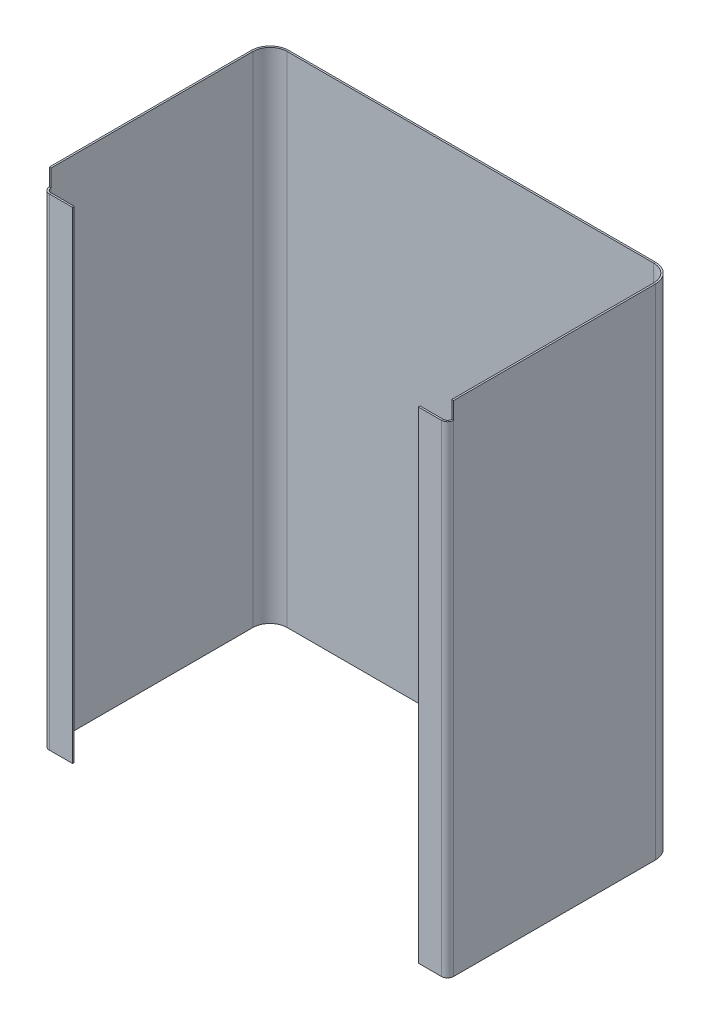
ISO-10303-21;
HEADER;
FILE_DESCRIPTION(('STEP AP214'),'2;1');
FILE_NAME('part.step','',(''),(''),'','','');
FILE_SCHEMA(('AUTOMOTIVE_DESIGN { 1 0 10303 214 1 1 1 1 }'));
ENDSEC;
DATA;
#1=APPLICATION_CONTEXT('core data for automotive mechanical design processes');
#2=APPLICATION_PROTOCOL_DEFINITION('international standard','automotive_design',2000,#1);
#3=PRODUCT_CONTEXT('',#1,'mechanical');
#4=PRODUCT('Part','Part','',(#3));
#5=PRODUCT_RELATED_PRODUCT_CATEGORY('part','',(#4));
#6=PRODUCT_DEFINITION_FORMATION('','',#4);
#7=PRODUCT_DEFINITION_CONTEXT('part definition',#1,'design');
#8=PRODUCT_DEFINITION('design','',#6,#7);
#9=PRODUCT_DEFINITION_SHAPE('','',#8);
#10=(LENGTH_UNIT() NAMED_UNIT(*) SI_UNIT(.MILLI.,.METRE.));
#11=(NAMED_UNIT(*) PLANE_ANGLE_UNIT() SI_UNIT($,.RADIAN.));
#12=(NAMED_UNIT(*) SI_UNIT($,.STERADIAN.) SOLID_ANGLE_UNIT());
#13=UNCERTAINTY_MEASURE_WITH_UNIT(LENGTH_MEASURE(1.E-05),#10,'distance_accuracy_value','');
#14=(GEOMETRIC_REPRESENTATION_CONTEXT(3) GLOBAL_UNCERTAINTY_ASSIGNED_CONTEXT((#13)) GLOBAL_UNIT_ASSIGNED_CONTEXT((#10,
#11,#12)) REPRESENTATION_CONTEXT('',''));
#15=CARTESIAN_POINT('',(0.,0.,0.));
#16=DIRECTION('',(0.,0.,1.));
#17=DIRECTION('',(1.,0.,0.));
#18=AXIS2_PLACEMENT_3D('',#15,#16,#17);
#19=CARTESIAN_POINT('',(-114.,-145.,128.326439119053));
#20=DIRECTION('',(0.,-1.,0.));
#21=DIRECTION('',(0.,0.,1.));
#22=AXIS2_PLACEMENT_3D('',#19,#20,#21);
#23=CYLINDRICAL_SURFACE('',#22,3.5);
#24=DIRECTION('',(0.,-1.,0.));
#25=VECTOR('',#24,1.);
#26=CARTESIAN_POINT('',(-114.,145.,131.826439119053));
#27=LINE('',#26,#25);
#28=CARTESIAN_POINT('',(-114.,-145.,131.826439119053));
#29=VERTEX_POINT('',#28);
#30=CARTESIAN_POINT('',(-114.,135.,131.826439119053));
#31=VERTEX_POINT('',#30);
#32=EDGE_CURVE('E290',#29,#31,#27,.F.);
#33=ORIENTED_EDGE('',*,*,#32,.T.);
#34=CARTESIAN_POINT('',(-114.,135.,128.326439119053));
#35=DIRECTION('',(0.,-1.,0.));
#36=DIRECTION('',(0.,0.,-1.));
#37=AXIS2_PLACEMENT_3D('',#34,#35,#36);
#38=CIRCLE('',#37,3.5);
#39=CARTESIAN_POINT('',(-117.5,135.,128.326439119053));
#40=VERTEX_POINT('',#39);
#41=EDGE_CURVE('E494',#31,#40,#38,.T.);
#42=ORIENTED_EDGE('',*,*,#41,.T.);
#43=DIRECTION('',(0.,-1.,0.));
#44=VECTOR('',#43,1.);
#45=CARTESIAN_POINT('',(-117.5,-145.,128.326439119053));
#46=LINE('',#45,#44);
#47=CARTESIAN_POINT('',(-117.5,-145.,128.326439119053));
#48=VERTEX_POINT('',#47);
#49=EDGE_CURVE('E301',#48,#40,#46,.F.);
#50=ORIENTED_EDGE('',*,*,#49,.F.);
#51=CARTESIAN_POINT('',(-114.,-145.,128.326439119053));
#52=DIRECTION('',(0.,-1.,0.));
#53=DIRECTION('',(0.,0.,-1.));
#54=AXIS2_PLACEMENT_3D('',#51,#52,#53);
#55=CIRCLE('',#54,3.5);
#56=EDGE_CURVE('E305',#29,#48,#55,.T.);
#57=ORIENTED_EDGE('',*,*,#56,.F.);
#58=EDGE_LOOP('',(#33,#42,#50,#57));
#59=FACE_BOUND('',#58,.T.);
#60=ADVANCED_FACE('F114',(#59),#23,.T.);
#61=CARTESIAN_POINT('',(-114.,-145.,128.326439119053));
#62=DIRECTION('',(0.,-1.,0.));
#63=DIRECTION('',(0.,0.,1.));
#64=AXIS2_PLACEMENT_3D('',#61,#62,#63);
#65=CYLINDRICAL_SURFACE('',#64,2.5);
#66=CARTESIAN_POINT('',(-114.,135.,128.326439119053));
#67=DIRECTION('',(0.,1.,0.));
#68=DIRECTION('',(0.,0.,1.));
#69=AXIS2_PLACEMENT_3D('',#66,#67,#68);
#70=CIRCLE('',#69,2.5);
#71=CARTESIAN_POINT('',(-114.,135.,130.826439119053));
#72=VERTEX_POINT('',#71);
#73=CARTESIAN_POINT('',(-116.5,135.,128.326439119053));
#74=VERTEX_POINT('',#73);
#75=EDGE_CURVE('E491',#72,#74,#70,.F.);
#76=ORIENTED_EDGE('',*,*,#75,.F.);
#77=DIRECTION('',(0.,-1.,0.));
#78=VECTOR('',#77,1.);
#79=CARTESIAN_POINT('',(-114.,145.,130.826439119053));
#80=LINE('',#79,#78);
#81=CARTESIAN_POINT('',(-114.,-145.,130.826439119053));
#82=VERTEX_POINT('',#81);
#83=EDGE_CURVE('E279',#72,#82,#80,.T.);
#84=ORIENTED_EDGE('',*,*,#83,.T.);
#85=CARTESIAN_POINT('',(-114.,-145.,128.326439119053));
#86=DIRECTION('',(0.,-1.,0.));
#87=DIRECTION('',(0.,0.,-1.));
#88=AXIS2_PLACEMENT_3D('',#85,#86,#87);
#89=CIRCLE('',#88,2.5);
#90=CARTESIAN_POINT('',(-116.5,-145.,128.326439119053));
#91=VERTEX_POINT('',#90);
#92=EDGE_CURVE('E311',#82,#91,#89,.T.);
#93=ORIENTED_EDGE('',*,*,#92,.T.);
#94=DIRECTION('',(0.,-1.,0.));
#95=VECTOR('',#94,1.);
#96=CARTESIAN_POINT('',(-116.5,-145.,128.326439119053));
#97=LINE('',#96,#95);
#98=EDGE_CURVE('E308',#91,#74,#97,.F.);
#99=ORIENTED_EDGE('',*,*,#98,.T.);
#100=EDGE_LOOP('',(#76,#84,#93,#99));
#101=FACE_BOUND('',#100,.T.);
#102=ADVANCED_FACE('F489',(#101),#65,.F.);
#103=CARTESIAN_POINT('',(-9.18221156115843E-13,0.,131.826439119054));
#104=DIRECTION('',(0.,0.,-1.));
#105=DIRECTION('',(-1.,0.,0.));
#106=AXIS2_PLACEMENT_3D('',#103,#104,#105);
#107=PLANE('',#106);
#108=DIRECTION('',(1.,0.,0.));
#109=VECTOR('',#108,1.);
#110=CARTESIAN_POINT('',(-107.25,135.,131.826439119053));
#111=LINE('',#110,#109);
#112=CARTESIAN_POINT('',(-100.5,135.,131.826439119053));
#113=VERTEX_POINT('',#112);
#114=EDGE_CURVE('E131',#31,#113,#111,.T.);
#115=ORIENTED_EDGE('',*,*,#114,.F.);
#116=ORIENTED_EDGE('',*,*,#32,.F.);
#117=DIRECTION('',(1.,0.,0.));
#118=VECTOR('',#117,1.);
#119=CARTESIAN_POINT('',(-9.18221156115843E-13,-145.,131.826439119054));
#120=LINE('',#119,#118);
#121=CARTESIAN_POINT('',(-100.5,-145.,131.826439119053));
#122=VERTEX_POINT('',#121);
#123=EDGE_CURVE('E285',#29,#122,#120,.T.);
#124=ORIENTED_EDGE('',*,*,#123,.T.);
#125=DIRECTION('',(0.,1.,0.));
#126=VECTOR('',#125,1.);
#127=CARTESIAN_POINT('',(-100.5,0.,131.826439119053));
#128=LINE('',#127,#126);
#129=EDGE_CURVE('E288',#122,#113,#128,.T.);
#130=ORIENTED_EDGE('',*,*,#129,.T.);
#131=EDGE_LOOP('',(#115,#116,#124,#130));
#132=FACE_BOUND('',#131,.T.);
#133=ADVANCED_FACE('F477',(#132),#107,.F.);
#134=CARTESIAN_POINT('',(-9.11441261326789E-13,0.,130.826439119054));
#135=DIRECTION('',(0.,0.,-1.));
#136=DIRECTION('',(-1.,0.,0.));
#137=AXIS2_PLACEMENT_3D('',#134,#135,#136);
#138=PLANE('',#137);
#139=ORIENTED_EDGE('',*,*,#83,.F.);
#140=DIRECTION('',(1.,0.,0.));
#141=VECTOR('',#140,1.);
#142=CARTESIAN_POINT('',(-116.5,135.,130.826439119053));
#143=LINE('',#142,#141);
#144=CARTESIAN_POINT('',(-100.5,135.,130.826439119053));
#145=VERTEX_POINT('',#144);
#146=EDGE_CURVE('E265',#72,#145,#143,.T.);
#147=ORIENTED_EDGE('',*,*,#146,.T.);
#148=DIRECTION('',(0.,-1.,0.));
#149=VECTOR('',#148,1.);
#150=CARTESIAN_POINT('',(-100.5,145.,130.826439119053));
#151=LINE('',#150,#149);
#152=CARTESIAN_POINT('',(-100.5,-145.,130.826439119053));
#153=VERTEX_POINT('',#152);
#154=EDGE_CURVE('E278',#153,#145,#151,.F.);
#155=ORIENTED_EDGE('',*,*,#154,.F.);
#156=DIRECTION('',(-1.,0.,0.));
#157=VECTOR('',#156,1.);
#158=CARTESIAN_POINT('',(-100.5,-145.,130.826439119053));
#159=LINE('',#158,#157);
#160=EDGE_CURVE('E286',#82,#153,#159,.F.);
#161=ORIENTED_EDGE('',*,*,#160,.F.);
#162=EDGE_LOOP('',(#139,#147,#155,#161));
#163=FACE_BOUND('',#162,.T.);
#164=ADVANCED_FACE('F276',(#163),#138,.T.);
#165=CARTESIAN_POINT('',(-100.5,145.,131.826439119053));
#166=DIRECTION('',(-1.,0.,0.));
#167=DIRECTION('',(0.,0.,1.));
#168=AXIS2_PLACEMENT_3D('',#165,#166,#167);
#169=PLANE('',#168);
#170=DIRECTION('',(0.,0.,1.));
#171=VECTOR('',#170,1.);
#172=CARTESIAN_POINT('',(-100.5,135.,130.826439119053));
#173=LINE('',#172,#171);
#174=EDGE_CURVE('E262',#113,#145,#173,.F.);
#175=ORIENTED_EDGE('',*,*,#174,.F.);
#176=ORIENTED_EDGE('',*,*,#129,.F.);
#177=DIRECTION('',(0.,0.,-1.));
#178=VECTOR('',#177,1.);
#179=CARTESIAN_POINT('',(-100.5,-145.,131.826439119053));
#180=LINE('',#179,#178);
#181=EDGE_CURVE('E284',#122,#153,#180,.T.);
#182=ORIENTED_EDGE('',*,*,#181,.T.);
#183=ORIENTED_EDGE('',*,*,#154,.T.);
#184=EDGE_LOOP('',(#175,#176,#182,#183));
#185=FACE_BOUND('',#184,.T.);
#186=ADVANCED_FACE('F282',(#185),#169,.F.);
#187=CARTESIAN_POINT('',(114.,145.,128.326439119053));
#188=DIRECTION('',(0.,1.,0.));
#189=DIRECTION('',(0.,0.,1.));
#190=AXIS2_PLACEMENT_3D('',#187,#188,#189);
#191=CYLINDRICAL_SURFACE('',#190,3.5);
#192=DIRECTION('',(0.,1.,0.));
#193=VECTOR('',#192,1.);
#194=CARTESIAN_POINT('',(117.5,145.,128.326439119053));
#195=LINE('',#194,#193);
#196=CARTESIAN_POINT('',(117.5,135.,128.326439119053));
#197=VERTEX_POINT('',#196);
#198=CARTESIAN_POINT('',(117.5,-145.,128.326439119053));
#199=VERTEX_POINT('',#198);
#200=EDGE_CURVE('E462',#197,#199,#195,.F.);
#201=ORIENTED_EDGE('',*,*,#200,.F.);
#202=CARTESIAN_POINT('',(114.,135.,128.326439119053));
#203=DIRECTION('',(0.,-1.,0.));
#204=DIRECTION('',(0.,0.,-1.));
#205=AXIS2_PLACEMENT_3D('',#202,#203,#204);
#206=CIRCLE('',#205,3.5);
#207=CARTESIAN_POINT('',(114.,135.,131.826439119053));
#208=VERTEX_POINT('',#207);
#209=EDGE_CURVE('E512',#197,#208,#206,.T.);
#210=ORIENTED_EDGE('',*,*,#209,.T.);
#211=DIRECTION('',(0.,1.,0.));
#212=VECTOR('',#211,1.);
#213=CARTESIAN_POINT('',(114.,-145.,131.826439119053));
#214=LINE('',#213,#212);
#215=CARTESIAN_POINT('',(114.,-145.,131.826439119053));
#216=VERTEX_POINT('',#215);
#217=EDGE_CURVE('E528',#208,#216,#214,.F.);
#218=ORIENTED_EDGE('',*,*,#217,.T.);
#219=CARTESIAN_POINT('',(114.,-145.,128.326439119053));
#220=DIRECTION('',(0.,1.,0.));
#221=DIRECTION('',(0.,0.,1.));
#222=AXIS2_PLACEMENT_3D('',#219,#220,#221);
#223=CIRCLE('',#222,3.5);
#224=EDGE_CURVE('E470',#199,#216,#223,.F.);
#225=ORIENTED_EDGE('',*,*,#224,.F.);
#226=EDGE_LOOP('',(#201,#210,#218,#225));
#227=FACE_BOUND('',#226,.T.);
#228=ADVANCED_FACE('F563',(#227),#191,.T.);
#229=CARTESIAN_POINT('',(114.,145.,128.326439119053));
#230=DIRECTION('',(0.,1.,0.));
#231=DIRECTION('',(0.,0.,1.));
#232=AXIS2_PLACEMENT_3D('',#229,#230,#231);
#233=CYLINDRICAL_SURFACE('',#232,2.5);
#234=CARTESIAN_POINT('',(114.,135.,128.326439119053));
#235=DIRECTION('',(0.,-1.,0.));
#236=DIRECTION('',(0.,0.,-1.));
#237=AXIS2_PLACEMENT_3D('',#234,#235,#236);
#238=CIRCLE('',#237,2.5);
#239=CARTESIAN_POINT('',(116.5,135.,128.326439119053));
#240=VERTEX_POINT('',#239);
#241=CARTESIAN_POINT('',(114.,135.,130.826439119053));
#242=VERTEX_POINT('',#241);
#243=EDGE_CURVE('E506',#240,#242,#238,.T.);
#244=ORIENTED_EDGE('',*,*,#243,.F.);
#245=DIRECTION('',(0.,1.,0.));
#246=VECTOR('',#245,1.);
#247=CARTESIAN_POINT('',(116.5,145.,128.326439119053));
#248=LINE('',#247,#246);
#249=CARTESIAN_POINT('',(116.5,-145.,128.326439119053));
#250=VERTEX_POINT('',#249);
#251=EDGE_CURVE('E449',#240,#250,#248,.F.);
#252=ORIENTED_EDGE('',*,*,#251,.T.);
#253=CARTESIAN_POINT('',(114.,-145.,128.326439119053));
#254=DIRECTION('',(0.,1.,0.));
#255=DIRECTION('',(0.,0.,1.));
#256=AXIS2_PLACEMENT_3D('',#253,#254,#255);
#257=CIRCLE('',#256,2.5);
#258=CARTESIAN_POINT('',(114.,-145.,130.826439119053));
#259=VERTEX_POINT('',#258);
#260=EDGE_CURVE('E453',#250,#259,#257,.F.);
#261=ORIENTED_EDGE('',*,*,#260,.T.);
#262=DIRECTION('',(0.,1.,0.));
#263=VECTOR('',#262,1.);
#264=CARTESIAN_POINT('',(114.,-145.,130.826439119053));
#265=LINE('',#264,#263);
#266=EDGE_CURVE('E530',#259,#242,#265,.T.);
#267=ORIENTED_EDGE('',*,*,#266,.T.);
#268=EDGE_LOOP('',(#244,#252,#261,#267));
#269=FACE_BOUND('',#268,.T.);
#270=ADVANCED_FACE('F553',(#269),#233,.F.);
#271=CARTESIAN_POINT('',(9.18221156115842E-13,0.,131.826439119054));
#272=DIRECTION('',(0.,0.,-1.));
#273=DIRECTION('',(-1.,0.,0.));
#274=AXIS2_PLACEMENT_3D('',#271,#272,#273);
#275=PLANE('',#274);
#276=DIRECTION('',(1.,0.,0.));
#277=VECTOR('',#276,1.);
#278=CARTESIAN_POINT('',(107.25,135.,131.826439119053));
#279=LINE('',#278,#277);
#280=CARTESIAN_POINT('',(100.5,135.,131.826439119053));
#281=VERTEX_POINT('',#280);
#282=EDGE_CURVE('E498',#281,#208,#279,.T.);
#283=ORIENTED_EDGE('',*,*,#282,.F.);
#284=DIRECTION('',(0.,-1.,0.));
#285=VECTOR('',#284,1.);
#286=CARTESIAN_POINT('',(100.5,0.,131.826439119053));
#287=LINE('',#286,#285);
#288=CARTESIAN_POINT('',(100.5,-145.,131.826439119053));
#289=VERTEX_POINT('',#288);
#290=EDGE_CURVE('E521',#281,#289,#287,.T.);
#291=ORIENTED_EDGE('',*,*,#290,.T.);
#292=DIRECTION('',(1.,0.,0.));
#293=VECTOR('',#292,1.);
#294=CARTESIAN_POINT('',(9.18221156115842E-13,-145.,131.826439119054));
#295=LINE('',#294,#293);
#296=EDGE_CURVE('E518',#289,#216,#295,.T.);
#297=ORIENTED_EDGE('',*,*,#296,.T.);
#298=ORIENTED_EDGE('',*,*,#217,.F.);
#299=EDGE_LOOP('',(#283,#291,#297,#298));
#300=FACE_BOUND('',#299,.T.);
#301=ADVANCED_FACE('F543',(#300),#275,.F.);
#302=CARTESIAN_POINT('',(9.11016949913858E-13,0.,130.826439119054));
#303=DIRECTION('',(0.,0.,-1.));
#304=DIRECTION('',(-1.,0.,0.));
#305=AXIS2_PLACEMENT_3D('',#302,#303,#304);
#306=PLANE('',#305);
#307=DIRECTION('',(0.,1.,0.));
#308=VECTOR('',#307,1.);
#309=CARTESIAN_POINT('',(100.5,-145.,130.826439119053));
#310=LINE('',#309,#308);
#311=CARTESIAN_POINT('',(100.5,135.,130.826439119053));
#312=VERTEX_POINT('',#311);
#313=CARTESIAN_POINT('',(100.5,-145.,130.826439119053));
#314=VERTEX_POINT('',#313);
#315=EDGE_CURVE('E526',#312,#314,#310,.F.);
#316=ORIENTED_EDGE('',*,*,#315,.F.);
#317=DIRECTION('',(1.,0.,0.));
#318=VECTOR('',#317,1.);
#319=CARTESIAN_POINT('',(-116.5,135.,130.826439119055));
#320=LINE('',#319,#318);
#321=EDGE_CURVE('E139',#312,#242,#320,.T.);
#322=ORIENTED_EDGE('',*,*,#321,.T.);
#323=ORIENTED_EDGE('',*,*,#266,.F.);
#324=DIRECTION('',(-1.,0.,0.));
#325=VECTOR('',#324,1.);
#326=CARTESIAN_POINT('',(116.5,-145.,130.826439119053));
#327=LINE('',#326,#325);
#328=EDGE_CURVE('E523',#314,#259,#327,.F.);
#329=ORIENTED_EDGE('',*,*,#328,.F.);
#330=EDGE_LOOP('',(#316,#322,#323,#329));
#331=FACE_BOUND('',#330,.T.);
#332=ADVANCED_FACE('F551',(#331),#306,.T.);
#333=CARTESIAN_POINT('',(100.5,-145.,131.826439119053));
#334=DIRECTION('',(1.,0.,0.));
#335=DIRECTION('',(0.,0.,-1.));
#336=AXIS2_PLACEMENT_3D('',#333,#334,#335);
#337=PLANE('',#336);
#338=DIRECTION('',(0.,0.,1.));
#339=VECTOR('',#338,1.);
#340=CARTESIAN_POINT('',(100.5,135.,130.826439119053));
#341=LINE('',#340,#339);
#342=EDGE_CURVE('E507',#281,#312,#341,.F.);
#343=ORIENTED_EDGE('',*,*,#342,.T.);
#344=ORIENTED_EDGE('',*,*,#315,.T.);
#345=DIRECTION('',(0.,0.,-1.));
#346=VECTOR('',#345,1.);
#347=CARTESIAN_POINT('',(100.5,-145.,131.826439119053));
#348=LINE('',#347,#346);
#349=EDGE_CURVE('E515',#289,#314,#348,.T.);
#350=ORIENTED_EDGE('',*,*,#349,.F.);
#351=ORIENTED_EDGE('',*,*,#290,.F.);
#352=EDGE_LOOP('',(#343,#344,#350,#351));
#353=FACE_BOUND('',#352,.T.);
#354=ADVANCED_FACE('F548',(#353),#337,.F.);
#355=CARTESIAN_POINT('',(117.5,145.,131.826439119053));
#356=DIRECTION('',(0.,-1.,0.));
#357=DIRECTION('',(0.,0.,-1.));
#358=AXIS2_PLACEMENT_3D('',#355,#356,#357);
#359=PLANE('',#358);
#360=DIRECTION('',(1.,0.,0.));
#361=VECTOR('',#360,1.);
#362=CARTESIAN_POINT('',(116.5,145.,128.326439119053));
#363=LINE('',#362,#361);
#364=CARTESIAN_POINT('',(116.5,145.,128.326439119053));
#365=VERTEX_POINT('',#364);
#366=CARTESIAN_POINT('',(117.5,145.,128.326439119053));
#367=VERTEX_POINT('',#366);
#368=EDGE_CURVE('E473',#365,#367,#363,.T.);
#369=ORIENTED_EDGE('',*,*,#368,.T.);
#370=DIRECTION('',(0.,0.,1.));
#371=VECTOR('',#370,1.);
#372=CARTESIAN_POINT('',(117.5,145.,-4.39736652757907E-13));
#373=LINE('',#372,#371);
#374=CARTESIAN_POINT('',(117.5,145.,10.9999999999999));
#375=VERTEX_POINT('',#374);
#376=EDGE_CURVE('E322',#375,#367,#373,.T.);
#377=ORIENTED_EDGE('',*,*,#376,.F.);
#378=DIRECTION('',(-1.,0.,0.));
#379=VECTOR('',#378,1.);
#380=CARTESIAN_POINT('',(116.5,145.,10.9999999999999));
#381=LINE('',#380,#379);
#382=CARTESIAN_POINT('',(116.5,145.,10.9999999999999));
#383=VERTEX_POINT('',#382);
#384=EDGE_CURVE('E333',#383,#375,#381,.F.);
#385=ORIENTED_EDGE('',*,*,#384,.F.);
#386=DIRECTION('',(0.,0.,-1.));
#387=VECTOR('',#386,1.);
#388=CARTESIAN_POINT('',(116.5,145.,131.826439119053));
#389=LINE('',#388,#387);
#390=EDGE_CURVE('E327',#383,#365,#389,.F.);
#391=ORIENTED_EDGE('',*,*,#390,.T.);
#392=EDGE_LOOP('',(#369,#377,#385,#391));
#393=FACE_BOUND('',#392,.T.);
#394=ADVANCED_FACE('F560',(#393),#359,.F.);
#395=CARTESIAN_POINT('',(117.5,-145.,0.999999999999953));
#396=DIRECTION('',(0.,1.,0.));
#397=DIRECTION('',(0.,0.,1.));
#398=AXIS2_PLACEMENT_3D('',#395,#396,#397);
#399=PLANE('',#398);
#400=DIRECTION('',(1.,0.,0.));
#401=VECTOR('',#400,1.);
#402=CARTESIAN_POINT('',(116.5,-145.,128.326439119053));
#403=LINE('',#402,#401);
#404=EDGE_CURVE('E300',#250,#199,#403,.T.);
#405=ORIENTED_EDGE('',*,*,#404,.F.);
#406=DIRECTION('',(0.,0.,1.));
#407=VECTOR('',#406,1.);
#408=CARTESIAN_POINT('',(116.5,-145.,0.999999999999957));
#409=LINE('',#408,#407);
#410=CARTESIAN_POINT('',(116.5,-145.,10.9999999999999));
#411=VERTEX_POINT('',#410);
#412=EDGE_CURVE('E325',#250,#411,#409,.F.);
#413=ORIENTED_EDGE('',*,*,#412,.T.);
#414=DIRECTION('',(-1.,0.,0.));
#415=VECTOR('',#414,1.);
#416=CARTESIAN_POINT('',(117.5,-145.,10.9999999999999));
#417=LINE('',#416,#415);
#418=CARTESIAN_POINT('',(117.5,-145.,10.9999999999999));
#419=VERTEX_POINT('',#418);
#420=EDGE_CURVE('E316',#411,#419,#417,.F.);
#421=ORIENTED_EDGE('',*,*,#420,.T.);
#422=DIRECTION('',(0.,0.,-1.));
#423=VECTOR('',#422,1.);
#424=CARTESIAN_POINT('',(117.5,-145.,-4.39736652757907E-13));
#425=LINE('',#424,#423);
#426=EDGE_CURVE('E319',#199,#419,#425,.T.);
#427=ORIENTED_EDGE('',*,*,#426,.F.);
#428=EDGE_LOOP('',(#405,#413,#421,#427));
#429=FACE_BOUND('',#428,.T.);
#430=ADVANCED_FACE('F441',(#429),#399,.F.);
#431=CARTESIAN_POINT('',(117.5,0.,-4.39736652757907E-13));
#432=DIRECTION('',(-1.,0.,0.));
#433=DIRECTION('',(0.,0.,1.));
#434=AXIS2_PLACEMENT_3D('',#431,#432,#433);
#435=PLANE('',#434);
#436=EDGE_CURVE('E465',#367,#197,#195,.F.);
#437=ORIENTED_EDGE('',*,*,#436,.T.);
#438=ORIENTED_EDGE('',*,*,#200,.T.);
#439=ORIENTED_EDGE('',*,*,#426,.T.);
#440=DIRECTION('',(0.,1.,0.));
#441=VECTOR('',#440,1.);
#442=CARTESIAN_POINT('',(117.5,-145.,10.9999999999999));
#443=LINE('',#442,#441);
#444=EDGE_CURVE('E330',#375,#419,#443,.F.);
#445=ORIENTED_EDGE('',*,*,#444,.F.);
#446=ORIENTED_EDGE('',*,*,#376,.T.);
#447=EDGE_LOOP('',(#437,#438,#439,#445,#446));
#448=FACE_BOUND('',#447,.T.);
#449=ADVANCED_FACE('F562',(#448),#435,.F.);
#450=CARTESIAN_POINT('',(116.5,0.,-4.36061474399191E-13));
#451=DIRECTION('',(-1.,0.,0.));
#452=DIRECTION('',(0.,0.,1.));
#453=AXIS2_PLACEMENT_3D('',#450,#451,#452);
#454=PLANE('',#453);
#455=ORIENTED_EDGE('',*,*,#412,.F.);
#456=ORIENTED_EDGE('',*,*,#251,.F.);
#457=EDGE_CURVE('E463',#365,#240,#248,.F.);
#458=ORIENTED_EDGE('',*,*,#457,.F.);
#459=ORIENTED_EDGE('',*,*,#390,.F.);
#460=DIRECTION('',(0.,1.,0.));
#461=VECTOR('',#460,1.);
#462=CARTESIAN_POINT('',(116.5,-145.,10.9999999999999));
#463=LINE('',#462,#461);
#464=EDGE_CURVE('E336',#411,#383,#463,.T.);
#465=ORIENTED_EDGE('',*,*,#464,.F.);
#466=EDGE_LOOP('',(#455,#456,#458,#459,#465));
#467=FACE_BOUND('',#466,.T.);
#468=ADVANCED_FACE('F447',(#467),#454,.T.);
#469=CARTESIAN_POINT('',(-117.5,145.,0.999999999999997));
#470=DIRECTION('',(0.,-1.,0.));
#471=DIRECTION('',(0.,0.,-1.));
#472=AXIS2_PLACEMENT_3D('',#469,#470,#471);
#473=PLANE('',#472);
#474=DIRECTION('',(-1.,0.,0.));
#475=VECTOR('',#474,1.);
#476=CARTESIAN_POINT('',(-116.5,145.,128.326439119053));
#477=LINE('',#476,#475);
#478=CARTESIAN_POINT('',(-116.5,145.,128.326439119053));
#479=VERTEX_POINT('',#478);
#480=CARTESIAN_POINT('',(-117.5,145.,128.326439119053));
#481=VERTEX_POINT('',#480);
#482=EDGE_CURVE('E314',#479,#481,#477,.T.);
#483=ORIENTED_EDGE('',*,*,#482,.F.);
#484=DIRECTION('',(0.,0.,1.));
#485=VECTOR('',#484,1.);
#486=CARTESIAN_POINT('',(-116.5,145.,1.));
#487=LINE('',#486,#485);
#488=CARTESIAN_POINT('',(-116.5,145.,11.));
#489=VERTEX_POINT('',#488);
#490=EDGE_CURVE('E371',#479,#489,#487,.F.);
#491=ORIENTED_EDGE('',*,*,#490,.T.);
#492=DIRECTION('',(1.,0.,0.));
#493=VECTOR('',#492,1.);
#494=CARTESIAN_POINT('',(-117.5,145.,11.));
#495=LINE('',#494,#493);
#496=CARTESIAN_POINT('',(-117.5,145.,11.));
#497=VERTEX_POINT('',#496);
#498=EDGE_CURVE('E360',#489,#497,#495,.F.);
#499=ORIENTED_EDGE('',*,*,#498,.T.);
#500=DIRECTION('',(0.,0.,-1.));
#501=VECTOR('',#500,1.);
#502=CARTESIAN_POINT('',(-117.5,145.,-3.89880061738585E-13));
#503=LINE('',#502,#501);
#504=EDGE_CURVE('E366',#481,#497,#503,.T.);
#505=ORIENTED_EDGE('',*,*,#504,.F.);
#506=EDGE_LOOP('',(#483,#491,#499,#505));
#507=FACE_BOUND('',#506,.T.);
#508=ADVANCED_FACE('F588',(#507),#473,.F.);
#509=CARTESIAN_POINT('',(-117.5,-145.,131.826439119053));
#510=DIRECTION('',(0.,1.,0.));
#511=DIRECTION('',(0.,0.,1.));
#512=AXIS2_PLACEMENT_3D('',#509,#510,#511);
#513=PLANE('',#512);
#514=DIRECTION('',(-1.,0.,0.));
#515=VECTOR('',#514,1.);
#516=CARTESIAN_POINT('',(-116.5,-145.,128.326439119053));
#517=LINE('',#516,#515);
#518=EDGE_CURVE('E304',#91,#48,#517,.T.);
#519=ORIENTED_EDGE('',*,*,#518,.T.);
#520=DIRECTION('',(0.,0.,1.));
#521=VECTOR('',#520,1.);
#522=CARTESIAN_POINT('',(-117.5,-145.,-3.89880061738585E-13));
#523=LINE('',#522,#521);
#524=CARTESIAN_POINT('',(-117.5,-145.,11.));
#525=VERTEX_POINT('',#524);
#526=EDGE_CURVE('E363',#525,#48,#523,.T.);
#527=ORIENTED_EDGE('',*,*,#526,.F.);
#528=DIRECTION('',(1.,0.,0.));
#529=VECTOR('',#528,1.);
#530=CARTESIAN_POINT('',(-116.5,-145.,11.));
#531=LINE('',#530,#529);
#532=CARTESIAN_POINT('',(-116.5,-145.,11.));
#533=VERTEX_POINT('',#532);
#534=EDGE_CURVE('E376',#533,#525,#531,.F.);
#535=ORIENTED_EDGE('',*,*,#534,.F.);
#536=DIRECTION('',(0.,0.,-1.));
#537=VECTOR('',#536,1.);
#538=CARTESIAN_POINT('',(-116.5,-145.,131.826439119053));
#539=LINE('',#538,#537);
#540=EDGE_CURVE('E368',#533,#91,#539,.F.);
#541=ORIENTED_EDGE('',*,*,#540,.T.);
#542=EDGE_LOOP('',(#519,#527,#535,#541));
#543=FACE_BOUND('',#542,.T.);
#544=ADVANCED_FACE('F606',(#543),#513,.F.);
#545=CARTESIAN_POINT('',(-117.5,0.,-3.89880061738585E-13));
#546=DIRECTION('',(1.,0.,0.));
#547=DIRECTION('',(0.,0.,-1.));
#548=AXIS2_PLACEMENT_3D('',#545,#546,#547);
#549=PLANE('',#548);
#550=ORIENTED_EDGE('',*,*,#49,.T.);
#551=DIRECTION('',(0.,-1.,0.));
#552=VECTOR('',#551,1.);
#553=CARTESIAN_POINT('',(-117.5,-145.,128.326439119053));
#554=LINE('',#553,#552);
#555=EDGE_CURVE('E500',#40,#481,#554,.F.);
#556=ORIENTED_EDGE('',*,*,#555,.T.);
#557=ORIENTED_EDGE('',*,*,#504,.T.);
#558=DIRECTION('',(0.,-1.,0.));
#559=VECTOR('',#558,1.);
#560=CARTESIAN_POINT('',(-117.5,145.,11.));
#561=LINE('',#560,#559);
#562=EDGE_CURVE('E373',#525,#497,#561,.F.);
#563=ORIENTED_EDGE('',*,*,#562,.F.);
#564=ORIENTED_EDGE('',*,*,#526,.T.);
#565=EDGE_LOOP('',(#550,#556,#557,#563,#564));
#566=FACE_BOUND('',#565,.T.);
#567=ADVANCED_FACE('F602',(#566),#549,.F.);
#568=CARTESIAN_POINT('',(-116.5,0.,-3.86572277419614E-13));
#569=DIRECTION('',(1.,0.,0.));
#570=DIRECTION('',(0.,0.,-1.));
#571=AXIS2_PLACEMENT_3D('',#568,#569,#570);
#572=PLANE('',#571);
#573=ORIENTED_EDGE('',*,*,#490,.F.);
#574=DIRECTION('',(0.,-1.,0.));
#575=VECTOR('',#574,1.);
#576=CARTESIAN_POINT('',(-116.5,-145.,128.326439119053));
#577=LINE('',#576,#575);
#578=EDGE_CURVE('E980',#74,#479,#577,.F.);
#579=ORIENTED_EDGE('',*,*,#578,.F.);
#580=ORIENTED_EDGE('',*,*,#98,.F.);
#581=ORIENTED_EDGE('',*,*,#540,.F.);
#582=DIRECTION('',(0.,-1.,0.));
#583=VECTOR('',#582,1.);
#584=CARTESIAN_POINT('',(-116.5,145.,11.));
#585=LINE('',#584,#583);
#586=EDGE_CURVE('E379',#489,#533,#585,.T.);
#587=ORIENTED_EDGE('',*,*,#586,.F.);
#588=EDGE_LOOP('',(#573,#579,#580,#581,#587));
#589=FACE_BOUND('',#588,.T.);
#590=ADVANCED_FACE('F605',(#589),#572,.T.);
#591=CARTESIAN_POINT('',(-117.5,145.,1.));
#592=DIRECTION('',(0.,0.,-1.));
#593=DIRECTION('',(-1.,0.,0.));
#594=AXIS2_PLACEMENT_3D('',#591,#592,#593);
#595=PLANE('',#594);
#596=DIRECTION('',(0.,1.,0.));
#597=VECTOR('',#596,1.);
#598=CARTESIAN_POINT('',(106.5,145.,0.999999999999989));
#599=LINE('',#598,#597);
#600=CARTESIAN_POINT('',(106.5,145.,0.999999999999989));
#601=VERTEX_POINT('',#600);
#602=CARTESIAN_POINT('',(106.5,-145.,0.999999999999963));
#603=VERTEX_POINT('',#602);
#604=EDGE_CURVE('E353',#601,#603,#599,.F.);
#605=ORIENTED_EDGE('',*,*,#604,.F.);
#606=DIRECTION('',(1.,0.,0.));
#607=VECTOR('',#606,1.);
#608=CARTESIAN_POINT('',(-117.5,145.,1.));
#609=LINE('',#608,#607);
#610=CARTESIAN_POINT('',(-106.5,145.,0.999999999999999));
#611=VERTEX_POINT('',#610);
#612=EDGE_CURVE('E123',#611,#601,#609,.T.);
#613=ORIENTED_EDGE('',*,*,#612,.F.);
#614=DIRECTION('',(0.,-1.,0.));
#615=VECTOR('',#614,1.);
#616=CARTESIAN_POINT('',(-106.5,-145.,0.999999999999999));
#617=LINE('',#616,#615);
#618=CARTESIAN_POINT('',(-106.5,-145.,0.999999999999999));
#619=VERTEX_POINT('',#618);
#620=EDGE_CURVE('E396',#619,#611,#617,.F.);
#621=ORIENTED_EDGE('',*,*,#620,.F.);
#622=DIRECTION('',(1.,0.,0.));
#623=VECTOR('',#622,1.);
#624=CARTESIAN_POINT('',(-117.5,-145.,1.));
#625=LINE('',#624,#623);
#626=EDGE_CURVE('E403',#619,#603,#625,.T.);
#627=ORIENTED_EDGE('',*,*,#626,.T.);
#628=EDGE_LOOP('',(#605,#613,#621,#627));
#629=FACE_BOUND('',#628,.T.);
#630=ADVANCED_FACE('F116',(#629),#595,.F.);
#631=CARTESIAN_POINT('',(-117.5,145.,0.));
#632=DIRECTION('',(0.,0.,-1.));
#633=DIRECTION('',(-1.,0.,0.));
#634=AXIS2_PLACEMENT_3D('',#631,#632,#633);
#635=PLANE('',#634);
#636=DIRECTION('',(1.,0.,0.));
#637=VECTOR('',#636,1.);
#638=CARTESIAN_POINT('',(-117.5,145.,0.));
#639=LINE('',#638,#637);
#640=CARTESIAN_POINT('',(-106.5,145.,0.));
#641=VERTEX_POINT('',#640);
#642=CARTESIAN_POINT('',(106.5,145.,0.));
#643=VERTEX_POINT('',#642);
#644=EDGE_CURVE('E13',#641,#643,#639,.T.);
#645=ORIENTED_EDGE('',*,*,#644,.T.);
#646=DIRECTION('',(0.,1.,0.));
#647=VECTOR('',#646,1.);
#648=CARTESIAN_POINT('',(106.5,145.,0.));
#649=LINE('',#648,#647);
#650=CARTESIAN_POINT('',(106.5,-145.,0.));
#651=VERTEX_POINT('',#650);
#652=EDGE_CURVE('E340',#643,#651,#649,.F.);
#653=ORIENTED_EDGE('',*,*,#652,.T.);
#654=DIRECTION('',(1.,0.,0.));
#655=VECTOR('',#654,1.);
#656=CARTESIAN_POINT('',(-117.5,-145.,0.));
#657=LINE('',#656,#655);
#658=CARTESIAN_POINT('',(-106.5,-145.,0.));
#659=VERTEX_POINT('',#658);
#660=EDGE_CURVE('E118',#659,#651,#657,.T.);
#661=ORIENTED_EDGE('',*,*,#660,.F.);
#662=DIRECTION('',(0.,-1.,0.));
#663=VECTOR('',#662,1.);
#664=CARTESIAN_POINT('',(-106.5,-145.,0.));
#665=LINE('',#664,#663);
#666=EDGE_CURVE('E383',#659,#641,#665,.F.);
#667=ORIENTED_EDGE('',*,*,#666,.T.);
#668=EDGE_LOOP('',(#645,#653,#661,#667));
#669=FACE_BOUND('',#668,.T.);
#670=ADVANCED_FACE('F418',(#669),#635,.T.);
#671=CARTESIAN_POINT('',(0.,145.,0.));
#672=DIRECTION('',(0.,-1.,0.));
#673=DIRECTION('',(-1.,0.,0.));
#674=AXIS2_PLACEMENT_3D('',#671,#672,#673);
#675=PLANE('',#674);
#676=DIRECTION('',(0.,0.,-1.));
#677=VECTOR('',#676,1.);
#678=CARTESIAN_POINT('',(106.5,145.,0.999999999999989));
#679=LINE('',#678,#677);
#680=EDGE_CURVE('E347',#601,#643,#679,.T.);
#681=ORIENTED_EDGE('',*,*,#680,.T.);
#682=ORIENTED_EDGE('',*,*,#644,.F.);
#683=DIRECTION('',(0.,0.,-1.));
#684=VECTOR('',#683,1.);
#685=CARTESIAN_POINT('',(-106.5,145.,0.999999999999999));
#686=LINE('',#685,#684);
#687=EDGE_CURVE('E400',#611,#641,#686,.T.);
#688=ORIENTED_EDGE('',*,*,#687,.F.);
#689=ORIENTED_EDGE('',*,*,#612,.T.);
#690=EDGE_LOOP('',(#681,#682,#688,#689));
#691=FACE_BOUND('',#690,.T.);
#692=ADVANCED_FACE('F428',(#691),#675,.F.);
#693=CARTESIAN_POINT('',(0.,-145.,0.));
#694=DIRECTION('',(0.,-1.,0.));
#695=DIRECTION('',(-1.,0.,0.));
#696=AXIS2_PLACEMENT_3D('',#693,#694,#695);
#697=PLANE('',#696);
#698=DIRECTION('',(0.,0.,-1.));
#699=VECTOR('',#698,1.);
#700=CARTESIAN_POINT('',(106.5,-145.,0.999999999999963));
#701=LINE('',#700,#699);
#702=EDGE_CURVE('E357',#603,#651,#701,.T.);
#703=ORIENTED_EDGE('',*,*,#702,.F.);
#704=ORIENTED_EDGE('',*,*,#626,.F.);
#705=DIRECTION('',(0.,0.,-1.));
#706=VECTOR('',#705,1.);
#707=CARTESIAN_POINT('',(-106.5,-145.,0.999999999999999));
#708=LINE('',#707,#706);
#709=EDGE_CURVE('E390',#619,#659,#708,.T.);
#710=ORIENTED_EDGE('',*,*,#709,.T.);
#711=ORIENTED_EDGE('',*,*,#660,.T.);
#712=EDGE_LOOP('',(#703,#704,#710,#711));
#713=FACE_BOUND('',#712,.T.);
#714=ADVANCED_FACE('F416',(#713),#697,.T.);
#715=CARTESIAN_POINT('',(-106.5,145.,11.));
#716=DIRECTION('',(0.,1.,0.));
#717=DIRECTION('',(0.,0.,1.));
#718=AXIS2_PLACEMENT_3D('',#715,#716,#717);
#719=PLANE('',#718);
#720=ORIENTED_EDGE('',*,*,#498,.F.);
#721=CARTESIAN_POINT('',(-106.5,145.,11.));
#722=DIRECTION('',(0.,-1.,0.));
#723=DIRECTION('',(0.,0.,-1.));
#724=AXIS2_PLACEMENT_3D('',#721,#722,#723);
#725=CIRCLE('',#724,9.99999999999999);
#726=EDGE_CURVE('E393',#611,#489,#725,.F.);
#727=ORIENTED_EDGE('',*,*,#726,.F.);
#728=ORIENTED_EDGE('',*,*,#687,.T.);
#729=CARTESIAN_POINT('',(-106.5,145.,11.));
#730=DIRECTION('',(0.,-1.,0.));
#731=DIRECTION('',(0.,0.,-1.));
#732=AXIS2_PLACEMENT_3D('',#729,#730,#731);
#733=CIRCLE('',#732,11.);
#734=EDGE_CURVE('E386',#641,#497,#733,.F.);
#735=ORIENTED_EDGE('',*,*,#734,.T.);
#736=EDGE_LOOP('',(#720,#727,#728,#735));
#737=FACE_BOUND('',#736,.T.);
#738=ADVANCED_FACE('F625',(#737),#719,.T.);
#739=CARTESIAN_POINT('',(-106.5,-145.,11.));
#740=DIRECTION('',(0.,1.,0.));
#741=DIRECTION('',(0.,0.,1.));
#742=AXIS2_PLACEMENT_3D('',#739,#740,#741);
#743=PLANE('',#742);
#744=CARTESIAN_POINT('',(-106.5,-145.,11.));
#745=DIRECTION('',(0.,-1.,0.));
#746=DIRECTION('',(0.,0.,-1.));
#747=AXIS2_PLACEMENT_3D('',#744,#745,#746);
#748=CIRCLE('',#747,9.99999999999999);
#749=EDGE_CURVE('E365',#533,#619,#748,.T.);
#750=ORIENTED_EDGE('',*,*,#749,.F.);
#751=ORIENTED_EDGE('',*,*,#534,.T.);
#752=CARTESIAN_POINT('',(-106.5,-145.,11.));
#753=DIRECTION('',(0.,-1.,0.));
#754=DIRECTION('',(0.,0.,-1.));
#755=AXIS2_PLACEMENT_3D('',#752,#753,#754);
#756=CIRCLE('',#755,11.);
#757=EDGE_CURVE('E387',#525,#659,#756,.T.);
#758=ORIENTED_EDGE('',*,*,#757,.T.);
#759=ORIENTED_EDGE('',*,*,#709,.F.);
#760=EDGE_LOOP('',(#750,#751,#758,#759));
#761=FACE_BOUND('',#760,.T.);
#762=ADVANCED_FACE('F620',(#761),#743,.F.);
#763=CARTESIAN_POINT('',(-106.5,-145.,11.));
#764=DIRECTION('',(0.,-1.,0.));
#765=DIRECTION('',(-1.,0.,0.));
#766=AXIS2_PLACEMENT_3D('',#763,#764,#765);
#767=CYLINDRICAL_SURFACE('',#766,11.);
#768=ORIENTED_EDGE('',*,*,#666,.F.);
#769=ORIENTED_EDGE('',*,*,#757,.F.);
#770=ORIENTED_EDGE('',*,*,#562,.T.);
#771=ORIENTED_EDGE('',*,*,#734,.F.);
#772=EDGE_LOOP('',(#768,#769,#770,#771));
#773=FACE_BOUND('',#772,.T.);
#774=ADVANCED_FACE('F617',(#773),#767,.T.);
#775=CARTESIAN_POINT('',(-106.5,-145.,11.));
#776=DIRECTION('',(0.,-1.,0.));
#777=DIRECTION('',(-1.,0.,0.));
#778=AXIS2_PLACEMENT_3D('',#775,#776,#777);
#779=CYLINDRICAL_SURFACE('',#778,9.99999999999999);
#780=ORIENTED_EDGE('',*,*,#620,.T.);
#781=ORIENTED_EDGE('',*,*,#726,.T.);
#782=ORIENTED_EDGE('',*,*,#586,.T.);
#783=ORIENTED_EDGE('',*,*,#749,.T.);
#784=EDGE_LOOP('',(#780,#781,#782,#783));
#785=FACE_BOUND('',#784,.T.);
#786=ADVANCED_FACE('F599',(#785),#779,.F.);
#787=CARTESIAN_POINT('',(106.5,-145.,11.));
#788=DIRECTION('',(0.,-1.,0.));
#789=DIRECTION('',(0.,0.,-1.));
#790=AXIS2_PLACEMENT_3D('',#787,#788,#789);
#791=PLANE('',#790);
#792=ORIENTED_EDGE('',*,*,#420,.F.);
#793=CARTESIAN_POINT('',(106.5,-145.,11.));
#794=DIRECTION('',(0.,1.,0.));
#795=DIRECTION('',(0.,0.,1.));
#796=AXIS2_PLACEMENT_3D('',#793,#794,#795);
#797=CIRCLE('',#796,9.99999999999999);
#798=EDGE_CURVE('E350',#603,#411,#797,.F.);
#799=ORIENTED_EDGE('',*,*,#798,.F.);
#800=ORIENTED_EDGE('',*,*,#702,.T.);
#801=CARTESIAN_POINT('',(106.5,-145.,11.));
#802=DIRECTION('',(0.,1.,0.));
#803=DIRECTION('',(0.,0.,1.));
#804=AXIS2_PLACEMENT_3D('',#801,#802,#803);
#805=CIRCLE('',#804,11.);
#806=EDGE_CURVE('E343',#651,#419,#805,.F.);
#807=ORIENTED_EDGE('',*,*,#806,.T.);
#808=EDGE_LOOP('',(#792,#799,#800,#807));
#809=FACE_BOUND('',#808,.T.);
#810=ADVANCED_FACE('F437',(#809),#791,.T.);
#811=CARTESIAN_POINT('',(106.5,145.,11.));
#812=DIRECTION('',(0.,-1.,0.));
#813=DIRECTION('',(0.,0.,-1.));
#814=AXIS2_PLACEMENT_3D('',#811,#812,#813);
#815=PLANE('',#814);
#816=CARTESIAN_POINT('',(106.5,145.,11.));
#817=DIRECTION('',(0.,1.,0.));
#818=DIRECTION('',(0.,0.,1.));
#819=AXIS2_PLACEMENT_3D('',#816,#817,#818);
#820=CIRCLE('',#819,9.99999999999999);
#821=EDGE_CURVE('E321',#383,#601,#820,.T.);
#822=ORIENTED_EDGE('',*,*,#821,.F.);
#823=ORIENTED_EDGE('',*,*,#384,.T.);
#824=CARTESIAN_POINT('',(106.5,145.,11.));
#825=DIRECTION('',(0.,1.,0.));
#826=DIRECTION('',(0.,0.,1.));
#827=AXIS2_PLACEMENT_3D('',#824,#825,#826);
#828=CIRCLE('',#827,11.);
#829=EDGE_CURVE('E344',#375,#643,#828,.T.);
#830=ORIENTED_EDGE('',*,*,#829,.T.);
#831=ORIENTED_EDGE('',*,*,#680,.F.);
#832=EDGE_LOOP('',(#822,#823,#830,#831));
#833=FACE_BOUND('',#832,.T.);
#834=ADVANCED_FACE('F424',(#833),#815,.F.);
#835=CARTESIAN_POINT('',(106.5,145.,11.));
#836=DIRECTION('',(0.,1.,0.));
#837=DIRECTION('',(1.,0.,0.));
#838=AXIS2_PLACEMENT_3D('',#835,#836,#837);
#839=CYLINDRICAL_SURFACE('',#838,11.);
#840=ORIENTED_EDGE('',*,*,#652,.F.);
#841=ORIENTED_EDGE('',*,*,#829,.F.);
#842=ORIENTED_EDGE('',*,*,#444,.T.);
#843=ORIENTED_EDGE('',*,*,#806,.F.);
#844=EDGE_LOOP('',(#840,#841,#842,#843));
#845=FACE_BOUND('',#844,.T.);
#846=ADVANCED_FACE('F421',(#845),#839,.T.);
#847=CARTESIAN_POINT('',(106.5,145.,11.));
#848=DIRECTION('',(0.,1.,0.));
#849=DIRECTION('',(1.,0.,0.));
#850=AXIS2_PLACEMENT_3D('',#847,#848,#849);
#851=CYLINDRICAL_SURFACE('',#850,9.99999999999999);
#852=ORIENTED_EDGE('',*,*,#604,.T.);
#853=ORIENTED_EDGE('',*,*,#798,.T.);
#854=ORIENTED_EDGE('',*,*,#464,.T.);
#855=ORIENTED_EDGE('',*,*,#821,.T.);
#856=EDGE_LOOP('',(#852,#853,#854,#855));
#857=FACE_BOUND('',#856,.T.);
#858=ADVANCED_FACE('F433',(#857),#851,.F.);
#859=CARTESIAN_POINT('',(-114.,-145.,128.326439119053));
#860=DIRECTION('',(0.,1.,0.));
#861=DIRECTION('',(0.,0.,1.));
#862=AXIS2_PLACEMENT_3D('',#859,#860,#861);
#863=PLANE('',#862);
#864=ORIENTED_EDGE('',*,*,#92,.F.);
#865=DIRECTION('',(0.,0.,-1.));
#866=VECTOR('',#865,1.);
#867=CARTESIAN_POINT('',(-114.,-145.,130.826439119053));
#868=LINE('',#867,#866);
#869=EDGE_CURVE('E296',#82,#29,#868,.F.);
#870=ORIENTED_EDGE('',*,*,#869,.T.);
#871=ORIENTED_EDGE('',*,*,#56,.T.);
#872=ORIENTED_EDGE('',*,*,#518,.F.);
#873=EDGE_LOOP('',(#864,#870,#871,#872));
#874=FACE_BOUND('',#873,.T.);
#875=ADVANCED_FACE('F485',(#874),#863,.F.);
#876=CARTESIAN_POINT('',(-100.5,-145.,131.826439119053));
#877=DIRECTION('',(0.,1.,0.));
#878=DIRECTION('',(0.,0.,1.));
#879=AXIS2_PLACEMENT_3D('',#876,#877,#878);
#880=PLANE('',#879);
#881=ORIENTED_EDGE('',*,*,#869,.F.);
#882=ORIENTED_EDGE('',*,*,#160,.T.);
#883=ORIENTED_EDGE('',*,*,#181,.F.);
#884=ORIENTED_EDGE('',*,*,#123,.F.);
#885=EDGE_LOOP('',(#881,#882,#883,#884));
#886=FACE_BOUND('',#885,.T.);
#887=ADVANCED_FACE('F482',(#886),#880,.F.);
#888=CARTESIAN_POINT('',(114.,-145.,128.326439119053));
#889=DIRECTION('',(0.,-1.,0.));
#890=DIRECTION('',(0.,0.,-1.));
#891=AXIS2_PLACEMENT_3D('',#888,#889,#890);
#892=PLANE('',#891);
#893=DIRECTION('',(0.,0.,-1.));
#894=VECTOR('',#893,1.);
#895=CARTESIAN_POINT('',(114.,-145.,131.826439119053));
#896=LINE('',#895,#894);
#897=EDGE_CURVE('E458',#259,#216,#896,.F.);
#898=ORIENTED_EDGE('',*,*,#897,.F.);
#899=ORIENTED_EDGE('',*,*,#260,.F.);
#900=ORIENTED_EDGE('',*,*,#404,.T.);
#901=ORIENTED_EDGE('',*,*,#224,.T.);
#902=EDGE_LOOP('',(#898,#899,#900,#901));
#903=FACE_BOUND('',#902,.T.);
#904=ADVANCED_FACE('F454',(#903),#892,.T.);
#905=CARTESIAN_POINT('',(116.5,-145.,131.826439119053));
#906=DIRECTION('',(0.,1.,0.));
#907=DIRECTION('',(0.,0.,1.));
#908=AXIS2_PLACEMENT_3D('',#905,#906,#907);
#909=PLANE('',#908);
#910=ORIENTED_EDGE('',*,*,#897,.T.);
#911=ORIENTED_EDGE('',*,*,#296,.F.);
#912=ORIENTED_EDGE('',*,*,#349,.T.);
#913=ORIENTED_EDGE('',*,*,#328,.T.);
#914=EDGE_LOOP('',(#910,#911,#912,#913));
#915=FACE_BOUND('',#914,.T.);
#916=ADVANCED_FACE('F538',(#915),#909,.F.);
#917=CARTESIAN_POINT('',(114.,135.,128.326439119053));
#918=DIRECTION('',(0.,1.,0.));
#919=DIRECTION('',(0.,0.,1.));
#920=AXIS2_PLACEMENT_3D('',#917,#918,#919);
#921=PLANE('',#920);
#922=DIRECTION('',(1.,0.,0.));
#923=VECTOR('',#922,1.);
#924=CARTESIAN_POINT('',(116.5,135.,128.326439119053));
#925=LINE('',#924,#923);
#926=EDGE_CURVE('E504',#240,#197,#925,.T.);
#927=ORIENTED_EDGE('',*,*,#926,.F.);
#928=ORIENTED_EDGE('',*,*,#243,.T.);
#929=DIRECTION('',(0.,0.,-1.));
#930=VECTOR('',#929,1.);
#931=CARTESIAN_POINT('',(114.,135.,131.826439119053));
#932=LINE('',#931,#930);
#933=EDGE_CURVE('E510',#208,#242,#932,.T.);
#934=ORIENTED_EDGE('',*,*,#933,.F.);
#935=ORIENTED_EDGE('',*,*,#209,.F.);
#936=EDGE_LOOP('',(#927,#928,#934,#935));
#937=FACE_BOUND('',#936,.T.);
#938=ADVANCED_FACE('F555',(#937),#921,.T.);
#939=CARTESIAN_POINT('',(116.5,140.,128.326439119053));
#940=DIRECTION('',(0.,0.,-1.));
#941=DIRECTION('',(0.,1.,0.));
#942=AXIS2_PLACEMENT_3D('',#939,#940,#941);
#943=PLANE('',#942);
#944=ORIENTED_EDGE('',*,*,#368,.F.);
#945=ORIENTED_EDGE('',*,*,#457,.T.);
#946=ORIENTED_EDGE('',*,*,#926,.T.);
#947=ORIENTED_EDGE('',*,*,#436,.F.);
#948=EDGE_LOOP('',(#944,#945,#946,#947));
#949=FACE_BOUND('',#948,.T.);
#950=ADVANCED_FACE('F558',(#949),#943,.F.);
#951=CARTESIAN_POINT('',(-116.5,135.,130.826439119055));
#952=DIRECTION('',(0.,-1.,0.));
#953=DIRECTION('',(1.,0.,0.));
#954=AXIS2_PLACEMENT_3D('',#951,#952,#953);
#955=PLANE('',#954);
#956=ORIENTED_EDGE('',*,*,#282,.T.);
#957=ORIENTED_EDGE('',*,*,#933,.T.);
#958=ORIENTED_EDGE('',*,*,#321,.F.);
#959=ORIENTED_EDGE('',*,*,#342,.F.);
#960=EDGE_LOOP('',(#956,#957,#958,#959));
#961=FACE_BOUND('',#960,.T.);
#962=ADVANCED_FACE('F931',(#961),#955,.F.);
#963=CARTESIAN_POINT('',(-114.,135.,128.326439119053));
#964=DIRECTION('',(0.,1.,0.));
#965=DIRECTION('',(0.,0.,1.));
#966=AXIS2_PLACEMENT_3D('',#963,#964,#965);
#967=PLANE('',#966);
#968=DIRECTION('',(0.,0.,-1.));
#969=VECTOR('',#968,1.);
#970=CARTESIAN_POINT('',(-114.,135.,131.826439119053));
#971=LINE('',#970,#969);
#972=EDGE_CURVE('E495',#31,#72,#971,.T.);
#973=ORIENTED_EDGE('',*,*,#972,.T.);
#974=ORIENTED_EDGE('',*,*,#75,.T.);
#975=DIRECTION('',(-1.,0.,0.));
#976=VECTOR('',#975,1.);
#977=CARTESIAN_POINT('',(-116.5,135.,128.326439119053));
#978=LINE('',#977,#976);
#979=EDGE_CURVE('E271',#74,#40,#978,.T.);
#980=ORIENTED_EDGE('',*,*,#979,.T.);
#981=ORIENTED_EDGE('',*,*,#41,.F.);
#982=EDGE_LOOP('',(#973,#974,#980,#981));
#983=FACE_BOUND('',#982,.T.);
#984=ADVANCED_FACE('F941',(#983),#967,.T.);
#985=CARTESIAN_POINT('',(-116.5,140.,128.326439119053));
#986=DIRECTION('',(0.,0.,-1.));
#987=DIRECTION('',(0.,-1.,0.));
#988=AXIS2_PLACEMENT_3D('',#985,#986,#987);
#989=PLANE('',#988);
#990=ORIENTED_EDGE('',*,*,#979,.F.);
#991=ORIENTED_EDGE('',*,*,#578,.T.);
#992=ORIENTED_EDGE('',*,*,#482,.T.);
#993=ORIENTED_EDGE('',*,*,#555,.F.);
#994=EDGE_LOOP('',(#990,#991,#992,#993));
#995=FACE_BOUND('',#994,.T.);
#996=ADVANCED_FACE('F951',(#995),#989,.F.);
#997=CARTESIAN_POINT('',(-116.5,135.,130.826439119053));
#998=DIRECTION('',(0.,-1.,0.));
#999=DIRECTION('',(1.,0.,0.));
#1000=AXIS2_PLACEMENT_3D('',#997,#998,#999);
#1001=PLANE('',#1000);
#1002=ORIENTED_EDGE('',*,*,#114,.T.);
#1003=ORIENTED_EDGE('',*,*,#174,.T.);
#1004=ORIENTED_EDGE('',*,*,#146,.F.);
#1005=ORIENTED_EDGE('',*,*,#972,.F.);
#1006=EDGE_LOOP('',(#1002,#1003,#1004,#1005));
#1007=FACE_BOUND('',#1006,.T.);
#1008=ADVANCED_FACE('F264',(#1007),#1001,.F.);
#1009=CLOSED_SHELL('',(#60,#102,#133,#164,#186,#228,#270,#301,#332,#354,#394,#430,#449,#468,
#508,#544,#567,#590,#630,#670,#692,#714,#738,#762,#774,#786,#810,#834,#846,#858,#875,#887,#904,
#916,#938,#950,#962,#984,#996,#1008));
#1010=MANIFOLD_SOLID_BREP('B2',#1009);
#1011=ADVANCED_BREP_SHAPE_REPRESENTATION('',(#18,#1010),#14);
#1012=SHAPE_DEFINITION_REPRESENTATION(#9,#1011);
ENDSEC;
END-ISO-10303-21;
